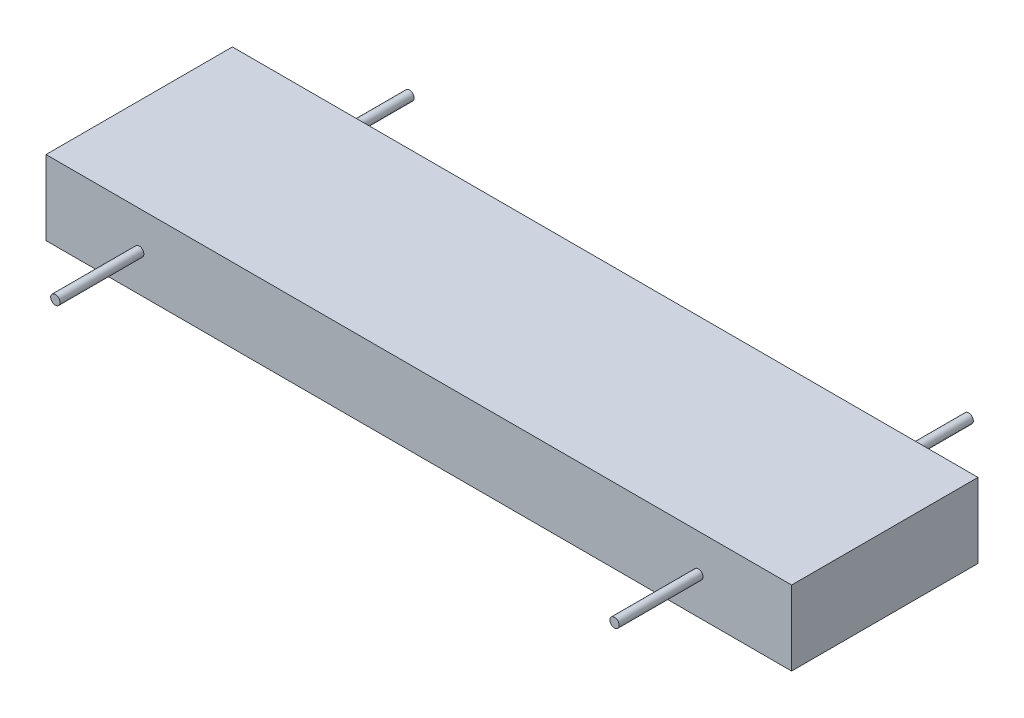
ISO-10303-21;
HEADER;
FILE_DESCRIPTION(('STEP AP214'),'2;1');
FILE_NAME('part.step','',(''),(''),'','','');
FILE_SCHEMA(('AUTOMOTIVE_DESIGN { 1 0 10303 214 1 1 1 1 }'));
ENDSEC;
DATA;
#1=APPLICATION_CONTEXT('core data for automotive mechanical design processes');
#2=APPLICATION_PROTOCOL_DEFINITION('international standard','automotive_design',2000,#1);
#3=PRODUCT_CONTEXT('',#1,'mechanical');
#4=PRODUCT('Part','Part','',(#3));
#5=PRODUCT_RELATED_PRODUCT_CATEGORY('part','',(#4));
#6=PRODUCT_DEFINITION_FORMATION('','',#4);
#7=PRODUCT_DEFINITION_CONTEXT('part definition',#1,'design');
#8=PRODUCT_DEFINITION('design','',#6,#7);
#9=PRODUCT_DEFINITION_SHAPE('','',#8);
#10=(LENGTH_UNIT() NAMED_UNIT(*) SI_UNIT(.MILLI.,.METRE.));
#11=(NAMED_UNIT(*) PLANE_ANGLE_UNIT() SI_UNIT($,.RADIAN.));
#12=(NAMED_UNIT(*) SI_UNIT($,.STERADIAN.) SOLID_ANGLE_UNIT());
#13=UNCERTAINTY_MEASURE_WITH_UNIT(LENGTH_MEASURE(1.E-05),#10,'distance_accuracy_value','');
#14=(GEOMETRIC_REPRESENTATION_CONTEXT(3) GLOBAL_UNCERTAINTY_ASSIGNED_CONTEXT((#13)) GLOBAL_UNIT_ASSIGNED_CONTEXT((#10,
#11,#12)) REPRESENTATION_CONTEXT('',''));
#15=CARTESIAN_POINT('',(0.,0.,0.));
#16=DIRECTION('',(0.,0.,1.));
#17=DIRECTION('',(1.,0.,0.));
#18=AXIS2_PLACEMENT_3D('',#15,#16,#17);
#19=CARTESIAN_POINT('',(100.,40.,90.));
#20=DIRECTION('',(0.,0.,-1.));
#21=DIRECTION('',(-1.,0.,0.));
#22=AXIS2_PLACEMENT_3D('',#19,#20,#21);
#23=CYLINDRICAL_SURFACE('',#22,5.);
#24=CARTESIAN_POINT('',(100.,40.,90.));
#25=DIRECTION('',(0.,0.,1.));
#26=DIRECTION('',(1.,0.,0.));
#27=AXIS2_PLACEMENT_3D('',#24,#25,#26);
#28=CIRCLE('',#27,5.);
#29=CARTESIAN_POINT('',(105.,40.,90.));
#30=VERTEX_POINT('',#29);
#31=EDGE_CURVE('P0_E10',#30,#30,#28,.T.);
#32=ORIENTED_EDGE('',*,*,#31,.F.);
#33=EDGE_LOOP('',(#32));
#34=FACE_BOUND('',#33,.T.);
#35=CARTESIAN_POINT('',(100.,40.,-290.));
#36=DIRECTION('',(0.,0.,1.));
#37=DIRECTION('',(1.,0.,0.));
#38=AXIS2_PLACEMENT_3D('',#35,#36,#37);
#39=CIRCLE('',#38,5.);
#40=CARTESIAN_POINT('',(105.,40.,-290.));
#41=VERTEX_POINT('',#40);
#42=EDGE_CURVE('P0_E18',#41,#41,#39,.T.);
#43=ORIENTED_EDGE('',*,*,#42,.T.);
#44=EDGE_LOOP('',(#43));
#45=FACE_BOUND('',#44,.T.);
#46=ADVANCED_FACE('P0_F15',(#34,#45),#23,.T.);
#47=CARTESIAN_POINT('',(100.,40.,90.));
#48=DIRECTION('',(0.,0.,1.));
#49=DIRECTION('',(1.,0.,0.));
#50=AXIS2_PLACEMENT_3D('',#47,#48,#49);
#51=PLANE('',#50);
#52=ORIENTED_EDGE('',*,*,#31,.T.);
#53=EDGE_LOOP('',(#52));
#54=FACE_BOUND('',#53,.T.);
#55=ADVANCED_FACE('P0_F30',(#54),#51,.T.);
#56=CARTESIAN_POINT('',(100.,40.,-290.));
#57=DIRECTION('',(0.,0.,1.));
#58=DIRECTION('',(1.,0.,0.));
#59=AXIS2_PLACEMENT_3D('',#56,#57,#58);
#60=PLANE('',#59);
#61=ORIENTED_EDGE('',*,*,#42,.F.);
#62=EDGE_LOOP('',(#61));
#63=FACE_BOUND('',#62,.T.);
#64=ADVANCED_FACE('P0_F28',(#63),#60,.F.);
#65=CLOSED_SHELL('',(#46,#55,#64));
#66=MANIFOLD_SOLID_BREP('P0_B1',#65);
#67=CARTESIAN_POINT('',(700.,40.,90.));
#68=DIRECTION('',(0.,0.,-1.));
#69=DIRECTION('',(-1.,0.,0.));
#70=AXIS2_PLACEMENT_3D('',#67,#68,#69);
#71=CYLINDRICAL_SURFACE('',#70,5.);
#72=CARTESIAN_POINT('',(700.,40.,90.));
#73=DIRECTION('',(0.,0.,1.));
#74=DIRECTION('',(1.,0.,0.));
#75=AXIS2_PLACEMENT_3D('',#72,#73,#74);
#76=CIRCLE('',#75,5.);
#77=CARTESIAN_POINT('',(705.,40.,90.));
#78=VERTEX_POINT('',#77);
#79=EDGE_CURVE('P1_E9',#78,#78,#76,.T.);
#80=ORIENTED_EDGE('',*,*,#79,.F.);
#81=EDGE_LOOP('',(#80));
#82=FACE_BOUND('',#81,.T.);
#83=CARTESIAN_POINT('',(700.,40.,-290.));
#84=DIRECTION('',(0.,0.,1.));
#85=DIRECTION('',(1.,0.,0.));
#86=AXIS2_PLACEMENT_3D('',#83,#84,#85);
#87=CIRCLE('',#86,5.);
#88=CARTESIAN_POINT('',(705.,40.,-290.));
#89=VERTEX_POINT('',#88);
#90=EDGE_CURVE('P1_E17',#89,#89,#87,.T.);
#91=ORIENTED_EDGE('',*,*,#90,.T.);
#92=EDGE_LOOP('',(#91));
#93=FACE_BOUND('',#92,.T.);
#94=ADVANCED_FACE('P1_F14',(#82,#93),#71,.T.);
#95=CARTESIAN_POINT('',(700.,40.,90.));
#96=DIRECTION('',(0.,0.,1.));
#97=DIRECTION('',(1.,0.,0.));
#98=AXIS2_PLACEMENT_3D('',#95,#96,#97);
#99=PLANE('',#98);
#100=ORIENTED_EDGE('',*,*,#79,.T.);
#101=EDGE_LOOP('',(#100));
#102=FACE_BOUND('',#101,.T.);
#103=ADVANCED_FACE('P1_F29',(#102),#99,.T.);
#104=CARTESIAN_POINT('',(700.,40.,-290.));
#105=DIRECTION('',(0.,0.,1.));
#106=DIRECTION('',(1.,0.,0.));
#107=AXIS2_PLACEMENT_3D('',#104,#105,#106);
#108=PLANE('',#107);
#109=ORIENTED_EDGE('',*,*,#90,.F.);
#110=EDGE_LOOP('',(#109));
#111=FACE_BOUND('',#110,.T.);
#112=ADVANCED_FACE('P1_F27',(#111),#108,.F.);
#113=CLOSED_SHELL('',(#94,#103,#112));
#114=MANIFOLD_SOLID_BREP('P1_B1',#113);
#115=CARTESIAN_POINT('',(0.,80.,0.));
#116=DIRECTION('',(1.,0.,0.));
#117=DIRECTION('',(0.,0.,-1.));
#118=AXIS2_PLACEMENT_3D('',#115,#116,#117);
#119=PLANE('',#118);
#120=DIRECTION('',(0.,0.,1.));
#121=VECTOR('',#120,1.);
#122=CARTESIAN_POINT('',(0.,0.,0.));
#123=LINE('',#122,#121);
#124=CARTESIAN_POINT('',(0.,0.,-200.));
#125=VERTEX_POINT('',#124);
#126=CARTESIAN_POINT('',(0.,0.,0.));
#127=VERTEX_POINT('',#126);
#128=EDGE_CURVE('P2_E80',#125,#127,#123,.T.);
#129=ORIENTED_EDGE('',*,*,#128,.T.);
#130=DIRECTION('',(0.,-1.,0.));
#131=VECTOR('',#130,1.);
#132=CARTESIAN_POINT('',(0.,80.,0.));
#133=LINE('',#132,#131);
#134=CARTESIAN_POINT('',(0.,80.,0.));
#135=VERTEX_POINT('',#134);
#136=EDGE_CURVE('P2_E11',#135,#127,#133,.T.);
#137=ORIENTED_EDGE('',*,*,#136,.F.);
#138=DIRECTION('',(0.,0.,1.));
#139=VECTOR('',#138,1.);
#140=CARTESIAN_POINT('',(0.,80.,0.));
#141=LINE('',#140,#139);
#142=CARTESIAN_POINT('',(0.,80.,-200.));
#143=VERTEX_POINT('',#142);
#144=EDGE_CURVE('P2_E68',#143,#135,#141,.T.);
#145=ORIENTED_EDGE('',*,*,#144,.F.);
#146=DIRECTION('',(0.,-1.,0.));
#147=VECTOR('',#146,1.);
#148=CARTESIAN_POINT('',(0.,80.,-200.));
#149=LINE('',#148,#147);
#150=EDGE_CURVE('P2_E76',#143,#125,#149,.T.);
#151=ORIENTED_EDGE('',*,*,#150,.T.);
#152=EDGE_LOOP('',(#129,#137,#145,#151));
#153=FACE_BOUND('',#152,.T.);
#154=ADVANCED_FACE('P2_F17',(#153),#119,.F.);
#155=CARTESIAN_POINT('',(0.,80.,0.));
#156=DIRECTION('',(0.,0.,-1.));
#157=DIRECTION('',(-1.,0.,0.));
#158=AXIS2_PLACEMENT_3D('',#155,#156,#157);
#159=PLANE('',#158);
#160=CARTESIAN_POINT('',(100.,40.,0.));
#161=DIRECTION('',(0.,0.,1.));
#162=DIRECTION('',(1.,0.,0.));
#163=AXIS2_PLACEMENT_3D('',#160,#161,#162);
#164=CIRCLE('',#163,4.99999999999999);
#165=CARTESIAN_POINT('',(105.,40.,0.));
#166=VERTEX_POINT('',#165);
#167=EDGE_CURVE('P2_E100',#166,#166,#164,.T.);
#168=ORIENTED_EDGE('',*,*,#167,.F.);
#169=EDGE_LOOP('',(#168));
#170=FACE_BOUND('',#169,.T.);
#171=CARTESIAN_POINT('',(700.,40.,0.));
#172=DIRECTION('',(0.,0.,1.));
#173=DIRECTION('',(1.,0.,0.));
#174=AXIS2_PLACEMENT_3D('',#171,#172,#173);
#175=CIRCLE('',#174,5.00000000000005);
#176=CARTESIAN_POINT('',(705.,40.,0.));
#177=VERTEX_POINT('',#176);
#178=EDGE_CURVE('P2_E94',#177,#177,#175,.T.);
#179=ORIENTED_EDGE('',*,*,#178,.F.);
#180=EDGE_LOOP('',(#179));
#181=FACE_BOUND('',#180,.T.);
#182=DIRECTION('',(1.,0.,0.));
#183=VECTOR('',#182,1.);
#184=CARTESIAN_POINT('',(0.,0.,0.));
#185=LINE('',#184,#183);
#186=CARTESIAN_POINT('',(800.,0.,0.));
#187=VERTEX_POINT('',#186);
#188=EDGE_CURVE('P2_E72',#127,#187,#185,.T.);
#189=ORIENTED_EDGE('',*,*,#188,.T.);
#190=DIRECTION('',(0.,-1.,0.));
#191=VECTOR('',#190,1.);
#192=CARTESIAN_POINT('',(800.,80.,0.));
#193=LINE('',#192,#191);
#194=CARTESIAN_POINT('',(800.,80.,0.));
#195=VERTEX_POINT('',#194);
#196=EDGE_CURVE('P2_E25',#195,#187,#193,.T.);
#197=ORIENTED_EDGE('',*,*,#196,.F.);
#198=DIRECTION('',(1.,0.,0.));
#199=VECTOR('',#198,1.);
#200=CARTESIAN_POINT('',(0.,80.,0.));
#201=LINE('',#200,#199);
#202=EDGE_CURVE('P2_E63',#135,#195,#201,.T.);
#203=ORIENTED_EDGE('',*,*,#202,.F.);
#204=ORIENTED_EDGE('',*,*,#136,.T.);
#205=EDGE_LOOP('',(#189,#197,#203,#204));
#206=FACE_BOUND('',#205,.T.);
#207=ADVANCED_FACE('P2_F71',(#170,#181,#206),#159,.F.);
#208=CARTESIAN_POINT('',(800.,80.,0.));
#209=DIRECTION('',(-1.,0.,0.));
#210=DIRECTION('',(0.,0.,1.));
#211=AXIS2_PLACEMENT_3D('',#208,#209,#210);
#212=PLANE('',#211);
#213=DIRECTION('',(0.,0.,-1.));
#214=VECTOR('',#213,1.);
#215=CARTESIAN_POINT('',(800.,0.,0.));
#216=LINE('',#215,#214);
#217=CARTESIAN_POINT('',(800.,0.,-200.));
#218=VERTEX_POINT('',#217);
#219=EDGE_CURVE('P2_E50',#187,#218,#216,.T.);
#220=ORIENTED_EDGE('',*,*,#219,.T.);
#221=DIRECTION('',(0.,-1.,0.));
#222=VECTOR('',#221,1.);
#223=CARTESIAN_POINT('',(800.,80.,-200.));
#224=LINE('',#223,#222);
#225=CARTESIAN_POINT('',(800.,80.,-200.));
#226=VERTEX_POINT('',#225);
#227=EDGE_CURVE('P2_E73',#226,#218,#224,.T.);
#228=ORIENTED_EDGE('',*,*,#227,.F.);
#229=DIRECTION('',(0.,0.,-1.));
#230=VECTOR('',#229,1.);
#231=CARTESIAN_POINT('',(800.,80.,0.));
#232=LINE('',#231,#230);
#233=EDGE_CURVE('P2_E66',#195,#226,#232,.T.);
#234=ORIENTED_EDGE('',*,*,#233,.F.);
#235=ORIENTED_EDGE('',*,*,#196,.T.);
#236=EDGE_LOOP('',(#220,#228,#234,#235));
#237=FACE_BOUND('',#236,.T.);
#238=ADVANCED_FACE('P2_F74',(#237),#212,.F.);
#239=CARTESIAN_POINT('',(0.,80.,-200.));
#240=DIRECTION('',(0.,0.,1.));
#241=DIRECTION('',(1.,0.,0.));
#242=AXIS2_PLACEMENT_3D('',#239,#240,#241);
#243=PLANE('',#242);
#244=CARTESIAN_POINT('',(100.,40.,-200.));
#245=DIRECTION('',(0.,0.,1.));
#246=DIRECTION('',(1.,0.,0.));
#247=AXIS2_PLACEMENT_3D('',#244,#245,#246);
#248=CIRCLE('',#247,4.99999999999999);
#249=CARTESIAN_POINT('',(105.,40.,-200.));
#250=VERTEX_POINT('',#249);
#251=EDGE_CURVE('P2_E83',#250,#250,#248,.T.);
#252=ORIENTED_EDGE('',*,*,#251,.T.);
#253=EDGE_LOOP('',(#252));
#254=FACE_BOUND('',#253,.T.);
#255=CARTESIAN_POINT('',(700.,40.,-200.));
#256=DIRECTION('',(0.,0.,1.));
#257=DIRECTION('',(1.,0.,0.));
#258=AXIS2_PLACEMENT_3D('',#255,#256,#257);
#259=CIRCLE('',#258,5.00000000000005);
#260=CARTESIAN_POINT('',(705.,40.,-200.));
#261=VERTEX_POINT('',#260);
#262=EDGE_CURVE('P2_E97',#261,#261,#259,.T.);
#263=ORIENTED_EDGE('',*,*,#262,.T.);
#264=EDGE_LOOP('',(#263));
#265=FACE_BOUND('',#264,.T.);
#266=DIRECTION('',(-1.,0.,0.));
#267=VECTOR('',#266,1.);
#268=CARTESIAN_POINT('',(0.,0.,-200.));
#269=LINE('',#268,#267);
#270=EDGE_CURVE('P2_E56',#218,#125,#269,.T.);
#271=ORIENTED_EDGE('',*,*,#270,.T.);
#272=ORIENTED_EDGE('',*,*,#150,.F.);
#273=DIRECTION('',(-1.,0.,0.));
#274=VECTOR('',#273,1.);
#275=CARTESIAN_POINT('',(0.,80.,-200.));
#276=LINE('',#275,#274);
#277=EDGE_CURVE('P2_E33',#226,#143,#276,.T.);
#278=ORIENTED_EDGE('',*,*,#277,.F.);
#279=ORIENTED_EDGE('',*,*,#227,.T.);
#280=EDGE_LOOP('',(#271,#272,#278,#279));
#281=FACE_BOUND('',#280,.T.);
#282=ADVANCED_FACE('P2_F88',(#254,#265,#281),#243,.F.);
#283=CARTESIAN_POINT('',(0.,80.,0.));
#284=DIRECTION('',(0.,-1.,0.));
#285=DIRECTION('',(0.,0.,-1.));
#286=AXIS2_PLACEMENT_3D('',#283,#284,#285);
#287=PLANE('',#286);
#288=ORIENTED_EDGE('',*,*,#144,.T.);
#289=ORIENTED_EDGE('',*,*,#202,.T.);
#290=ORIENTED_EDGE('',*,*,#233,.T.);
#291=ORIENTED_EDGE('',*,*,#277,.T.);
#292=EDGE_LOOP('',(#288,#289,#290,#291));
#293=FACE_BOUND('',#292,.T.);
#294=ADVANCED_FACE('P2_F64',(#293),#287,.F.);
#295=CARTESIAN_POINT('',(0.,0.,0.));
#296=DIRECTION('',(0.,-1.,0.));
#297=DIRECTION('',(0.,0.,-1.));
#298=AXIS2_PLACEMENT_3D('',#295,#296,#297);
#299=PLANE('',#298);
#300=ORIENTED_EDGE('',*,*,#128,.F.);
#301=ORIENTED_EDGE('',*,*,#270,.F.);
#302=ORIENTED_EDGE('',*,*,#219,.F.);
#303=ORIENTED_EDGE('',*,*,#188,.F.);
#304=EDGE_LOOP('',(#300,#301,#302,#303));
#305=FACE_BOUND('',#304,.T.);
#306=ADVANCED_FACE('P2_F91',(#305),#299,.T.);
#307=CARTESIAN_POINT('',(700.,40.,-200.));
#308=DIRECTION('',(0.,0.,1.));
#309=DIRECTION('',(1.,0.,0.));
#310=AXIS2_PLACEMENT_3D('',#307,#308,#309);
#311=CYLINDRICAL_SURFACE('',#310,5.00000000000005);
#312=ORIENTED_EDGE('',*,*,#262,.F.);
#313=EDGE_LOOP('',(#312));
#314=FACE_BOUND('',#313,.T.);
#315=ORIENTED_EDGE('',*,*,#178,.T.);
#316=EDGE_LOOP('',(#315));
#317=FACE_BOUND('',#316,.T.);
#318=ADVANCED_FACE('P2_F111',(#314,#317),#311,.F.);
#319=CARTESIAN_POINT('',(100.,40.,-200.));
#320=DIRECTION('',(0.,0.,1.));
#321=DIRECTION('',(1.,0.,0.));
#322=AXIS2_PLACEMENT_3D('',#319,#320,#321);
#323=CYLINDRICAL_SURFACE('',#322,4.99999999999999);
#324=ORIENTED_EDGE('',*,*,#251,.F.);
#325=EDGE_LOOP('',(#324));
#326=FACE_BOUND('',#325,.T.);
#327=ORIENTED_EDGE('',*,*,#167,.T.);
#328=EDGE_LOOP('',(#327));
#329=FACE_BOUND('',#328,.T.);
#330=ADVANCED_FACE('P2_F108',(#326,#329),#323,.F.);
#331=CLOSED_SHELL('',(#154,#207,#238,#282,#294,#306,#318,#330));
#332=MANIFOLD_SOLID_BREP('P2_B1',#331);
#333=ADVANCED_BREP_SHAPE_REPRESENTATION('',(#18,#66,#114,#332),#14);
#334=SHAPE_DEFINITION_REPRESENTATION(#9,#333);
ENDSEC;
END-ISO-10303-21;
